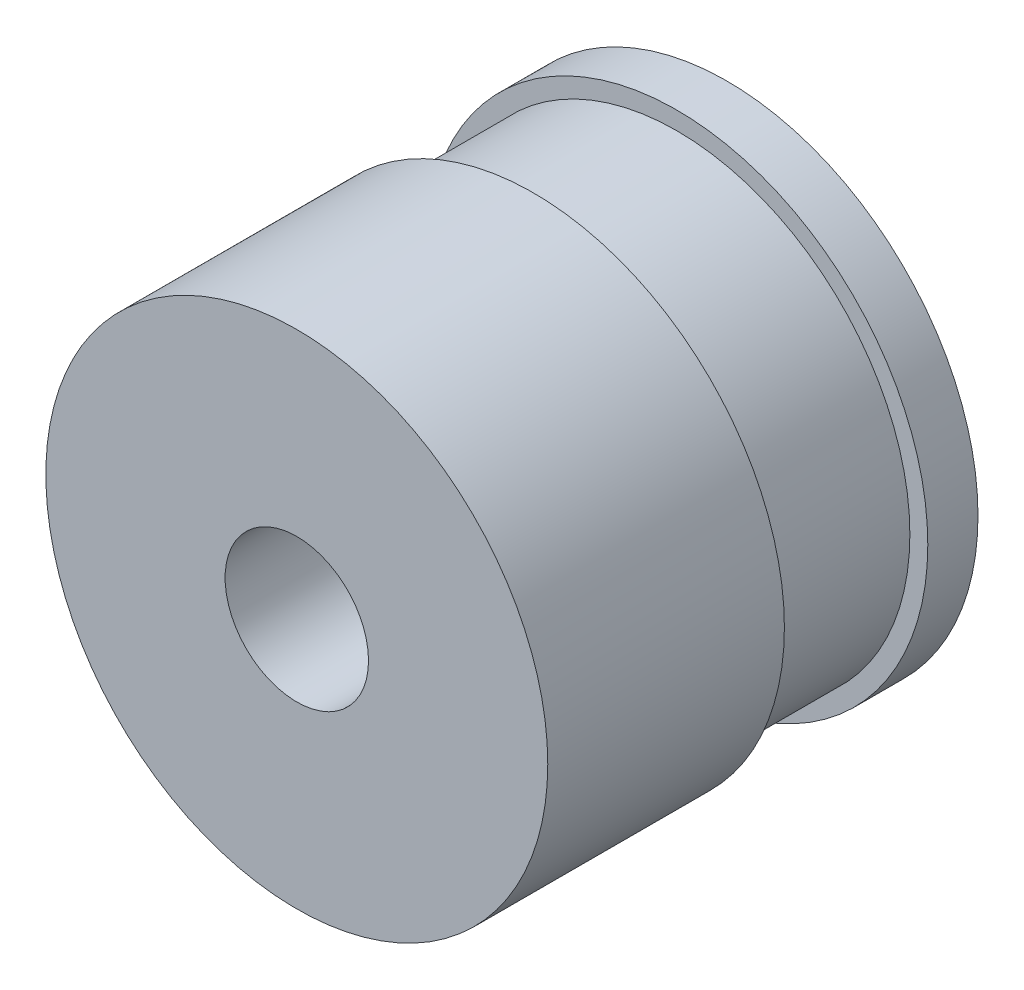
ISO-10303-21;
HEADER;
FILE_DESCRIPTION(('STEP AP214'),'2;1');
FILE_NAME('part.step','',(''),(''),'','','');
FILE_SCHEMA(('AUTOMOTIVE_DESIGN { 1 0 10303 214 1 1 1 1 }'));
ENDSEC;
DATA;
#1=APPLICATION_CONTEXT('core data for automotive mechanical design processes');
#2=APPLICATION_PROTOCOL_DEFINITION('international standard','automotive_design',2000,#1);
#3=PRODUCT_CONTEXT('',#1,'mechanical');
#4=PRODUCT('Part','Part','',(#3));
#5=PRODUCT_RELATED_PRODUCT_CATEGORY('part','',(#4));
#6=PRODUCT_DEFINITION_FORMATION('','',#4);
#7=PRODUCT_DEFINITION_CONTEXT('part definition',#1,'design');
#8=PRODUCT_DEFINITION('design','',#6,#7);
#9=PRODUCT_DEFINITION_SHAPE('','',#8);
#10=(LENGTH_UNIT() NAMED_UNIT(*) SI_UNIT(.MILLI.,.METRE.));
#11=(NAMED_UNIT(*) PLANE_ANGLE_UNIT() SI_UNIT($,.RADIAN.));
#12=(NAMED_UNIT(*) SI_UNIT($,.STERADIAN.) SOLID_ANGLE_UNIT());
#13=UNCERTAINTY_MEASURE_WITH_UNIT(LENGTH_MEASURE(1.E-05),#10,'distance_accuracy_value','');
#14=(GEOMETRIC_REPRESENTATION_CONTEXT(3) GLOBAL_UNCERTAINTY_ASSIGNED_CONTEXT((#13)) GLOBAL_UNIT_ASSIGNED_CONTEXT((#10,
#11,#12)) REPRESENTATION_CONTEXT('',''));
#15=CARTESIAN_POINT('',(0.,0.,0.));
#16=DIRECTION('',(0.,0.,1.));
#17=DIRECTION('',(1.,0.,0.));
#18=AXIS2_PLACEMENT_3D('',#15,#16,#17);
#19=CARTESIAN_POINT('',(0.,0.,7.));
#20=DIRECTION('',(0.,0.,1.));
#21=DIRECTION('',(1.,0.,0.));
#22=AXIS2_PLACEMENT_3D('',#19,#20,#21);
#23=PLANE('',#22);
#24=CARTESIAN_POINT('',(0.,0.,7.));
#25=DIRECTION('',(0.,0.,1.));
#26=DIRECTION('',(1.,0.,0.));
#27=AXIS2_PLACEMENT_3D('',#24,#25,#26);
#28=CIRCLE('',#27,35.);
#29=CARTESIAN_POINT('',(35.,0.,7.));
#30=VERTEX_POINT('',#29);
#31=EDGE_CURVE('E10',#30,#30,#28,.T.);
#32=ORIENTED_EDGE('',*,*,#31,.T.);
#33=EDGE_LOOP('',(#32));
#34=FACE_BOUND('',#33,.T.);
#35=CARTESIAN_POINT('',(0.,0.,7.));
#36=DIRECTION('',(0.,0.,1.));
#37=DIRECTION('',(1.,0.,0.));
#38=AXIS2_PLACEMENT_3D('',#35,#36,#37);
#39=CIRCLE('',#38,32.5);
#40=CARTESIAN_POINT('',(32.5,0.,7.));
#41=VERTEX_POINT('',#40);
#42=EDGE_CURVE('E47',#41,#41,#39,.T.);
#43=ORIENTED_EDGE('',*,*,#42,.F.);
#44=EDGE_LOOP('',(#43));
#45=FACE_BOUND('',#44,.T.);
#46=ADVANCED_FACE('F31',(#34,#45),#23,.T.);
#47=CARTESIAN_POINT('',(0.,0.,0.));
#48=DIRECTION('',(0.,0.,1.));
#49=DIRECTION('',(1.,0.,0.));
#50=AXIS2_PLACEMENT_3D('',#47,#48,#49);
#51=PLANE('',#50);
#52=CARTESIAN_POINT('',(0.,0.,0.));
#53=DIRECTION('',(0.,0.,1.));
#54=DIRECTION('',(1.,0.,0.));
#55=AXIS2_PLACEMENT_3D('',#52,#53,#54);
#56=CIRCLE('',#55,35.);
#57=CARTESIAN_POINT('',(35.,0.,0.));
#58=VERTEX_POINT('',#57);
#59=EDGE_CURVE('E35',#58,#58,#56,.T.);
#60=ORIENTED_EDGE('',*,*,#59,.F.);
#61=EDGE_LOOP('',(#60));
#62=FACE_BOUND('',#61,.T.);
#63=CARTESIAN_POINT('',(0.,0.,0.));
#64=DIRECTION('',(0.,0.,1.));
#65=DIRECTION('',(1.,0.,0.));
#66=AXIS2_PLACEMENT_3D('',#63,#64,#65);
#67=CIRCLE('',#66,10.);
#68=CARTESIAN_POINT('',(10.,0.,0.));
#69=VERTEX_POINT('',#68);
#70=EDGE_CURVE('E42',#69,#69,#67,.T.);
#71=ORIENTED_EDGE('',*,*,#70,.T.);
#72=EDGE_LOOP('',(#71));
#73=FACE_BOUND('',#72,.T.);
#74=ADVANCED_FACE('F80',(#62,#73),#51,.F.);
#75=CARTESIAN_POINT('',(0.,0.,7.));
#76=DIRECTION('',(0.,0.,-1.));
#77=DIRECTION('',(-1.,0.,0.));
#78=AXIS2_PLACEMENT_3D('',#75,#76,#77);
#79=CYLINDRICAL_SURFACE('',#78,35.);
#80=ORIENTED_EDGE('',*,*,#31,.F.);
#81=EDGE_LOOP('',(#80));
#82=FACE_BOUND('',#81,.T.);
#83=ORIENTED_EDGE('',*,*,#59,.T.);
#84=EDGE_LOOP('',(#83));
#85=FACE_BOUND('',#84,.T.);
#86=ADVANCED_FACE('F33',(#82,#85),#79,.T.);
#87=CARTESIAN_POINT('',(0.,0.,7.));
#88=DIRECTION('',(0.,0.,-1.));
#89=DIRECTION('',(-1.,0.,0.));
#90=AXIS2_PLACEMENT_3D('',#87,#88,#89);
#91=CYLINDRICAL_SURFACE('',#90,10.);
#92=ORIENTED_EDGE('',*,*,#70,.F.);
#93=EDGE_LOOP('',(#92));
#94=FACE_BOUND('',#93,.T.);
#95=CARTESIAN_POINT('',(0.,0.,60.));
#96=DIRECTION('',(0.,0.,1.));
#97=DIRECTION('',(1.,0.,0.));
#98=AXIS2_PLACEMENT_3D('',#95,#96,#97);
#99=CIRCLE('',#98,10.);
#100=CARTESIAN_POINT('',(10.,0.,60.));
#101=VERTEX_POINT('',#100);
#102=EDGE_CURVE('E56',#101,#101,#99,.T.);
#103=ORIENTED_EDGE('',*,*,#102,.T.);
#104=EDGE_LOOP('',(#103));
#105=FACE_BOUND('',#104,.T.);
#106=ADVANCED_FACE('F62',(#94,#105),#91,.F.);
#107=CARTESIAN_POINT('',(0.,0.,27.));
#108=DIRECTION('',(0.,0.,-1.));
#109=DIRECTION('',(-1.,0.,0.));
#110=AXIS2_PLACEMENT_3D('',#107,#108,#109);
#111=CYLINDRICAL_SURFACE('',#110,32.5);
#112=CARTESIAN_POINT('',(0.,0.,27.));
#113=DIRECTION('',(0.,0.,1.));
#114=DIRECTION('',(1.,0.,0.));
#115=AXIS2_PLACEMENT_3D('',#112,#113,#114);
#116=CIRCLE('',#115,32.5);
#117=CARTESIAN_POINT('',(32.5,0.,27.));
#118=VERTEX_POINT('',#117);
#119=EDGE_CURVE('E46',#118,#118,#116,.T.);
#120=ORIENTED_EDGE('',*,*,#119,.F.);
#121=EDGE_LOOP('',(#120));
#122=FACE_BOUND('',#121,.T.);
#123=ORIENTED_EDGE('',*,*,#42,.T.);
#124=EDGE_LOOP('',(#123));
#125=FACE_BOUND('',#124,.T.);
#126=ADVANCED_FACE('F76',(#122,#125),#111,.T.);
#127=CARTESIAN_POINT('',(0.,0.,27.));
#128=DIRECTION('',(0.,0.,1.));
#129=DIRECTION('',(1.,0.,0.));
#130=AXIS2_PLACEMENT_3D('',#127,#128,#129);
#131=PLANE('',#130);
#132=CARTESIAN_POINT('',(0.,0.,27.));
#133=DIRECTION('',(0.,0.,1.));
#134=DIRECTION('',(1.,0.,0.));
#135=AXIS2_PLACEMENT_3D('',#132,#133,#134);
#136=CIRCLE('',#135,35.);
#137=CARTESIAN_POINT('',(35.,0.,27.));
#138=VERTEX_POINT('',#137);
#139=EDGE_CURVE('E53',#138,#138,#136,.T.);
#140=ORIENTED_EDGE('',*,*,#139,.F.);
#141=EDGE_LOOP('',(#140));
#142=FACE_BOUND('',#141,.T.);
#143=ORIENTED_EDGE('',*,*,#119,.T.);
#144=EDGE_LOOP('',(#143));
#145=FACE_BOUND('',#144,.T.);
#146=ADVANCED_FACE('F67',(#142,#145),#131,.F.);
#147=CARTESIAN_POINT('',(0.,0.,60.));
#148=DIRECTION('',(0.,0.,1.));
#149=DIRECTION('',(1.,0.,0.));
#150=AXIS2_PLACEMENT_3D('',#147,#148,#149);
#151=PLANE('',#150);
#152=CARTESIAN_POINT('',(0.,0.,60.));
#153=DIRECTION('',(0.,0.,1.));
#154=DIRECTION('',(1.,0.,0.));
#155=AXIS2_PLACEMENT_3D('',#152,#153,#154);
#156=CIRCLE('',#155,35.);
#157=CARTESIAN_POINT('',(35.,0.,60.));
#158=VERTEX_POINT('',#157);
#159=EDGE_CURVE('E50',#158,#158,#156,.T.);
#160=ORIENTED_EDGE('',*,*,#159,.T.);
#161=EDGE_LOOP('',(#160));
#162=FACE_BOUND('',#161,.T.);
#163=ORIENTED_EDGE('',*,*,#102,.F.);
#164=EDGE_LOOP('',(#163));
#165=FACE_BOUND('',#164,.T.);
#166=ADVANCED_FACE('F64',(#162,#165),#151,.T.);
#167=CARTESIAN_POINT('',(0.,0.,60.));
#168=DIRECTION('',(0.,0.,-1.));
#169=DIRECTION('',(-1.,0.,0.));
#170=AXIS2_PLACEMENT_3D('',#167,#168,#169);
#171=CYLINDRICAL_SURFACE('',#170,35.);
#172=ORIENTED_EDGE('',*,*,#159,.F.);
#173=EDGE_LOOP('',(#172));
#174=FACE_BOUND('',#173,.T.);
#175=ORIENTED_EDGE('',*,*,#139,.T.);
#176=EDGE_LOOP('',(#175));
#177=FACE_BOUND('',#176,.T.);
#178=ADVANCED_FACE('F66',(#174,#177),#171,.T.);
#179=CLOSED_SHELL('',(#46,#74,#86,#106,#126,#146,#166,#178));
#180=MANIFOLD_SOLID_BREP('B2',#179);
#181=ADVANCED_BREP_SHAPE_REPRESENTATION('',(#18,#180),#14);
#182=SHAPE_DEFINITION_REPRESENTATION(#9,#181);
ENDSEC;
END-ISO-10303-21;
